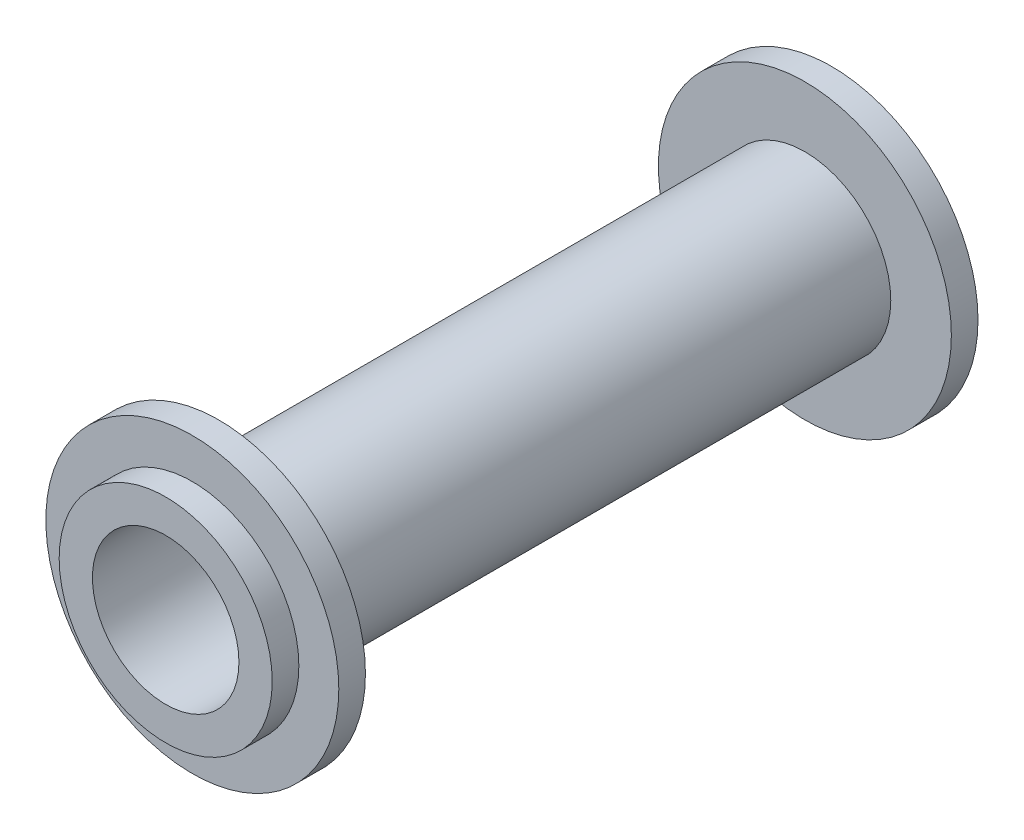
ISO-10303-21;
HEADER;
FILE_DESCRIPTION(('STEP AP214'),'2;1');
FILE_NAME('part.step','',(''),(''),'','','');
FILE_SCHEMA(('AUTOMOTIVE_DESIGN { 1 0 10303 214 1 1 1 1 }'));
ENDSEC;
DATA;
#1=APPLICATION_CONTEXT('core data for automotive mechanical design processes');
#2=APPLICATION_PROTOCOL_DEFINITION('international standard','automotive_design',2000,#1);
#3=PRODUCT_CONTEXT('',#1,'mechanical');
#4=PRODUCT('Part','Part','',(#3));
#5=PRODUCT_RELATED_PRODUCT_CATEGORY('part','',(#4));
#6=PRODUCT_DEFINITION_FORMATION('','',#4);
#7=PRODUCT_DEFINITION_CONTEXT('part definition',#1,'design');
#8=PRODUCT_DEFINITION('design','',#6,#7);
#9=PRODUCT_DEFINITION_SHAPE('','',#8);
#10=(LENGTH_UNIT() NAMED_UNIT(*) SI_UNIT(.MILLI.,.METRE.));
#11=(NAMED_UNIT(*) PLANE_ANGLE_UNIT() SI_UNIT($,.RADIAN.));
#12=(NAMED_UNIT(*) SI_UNIT($,.STERADIAN.) SOLID_ANGLE_UNIT());
#13=UNCERTAINTY_MEASURE_WITH_UNIT(LENGTH_MEASURE(1.E-05),#10,'distance_accuracy_value','');
#14=(GEOMETRIC_REPRESENTATION_CONTEXT(3) GLOBAL_UNCERTAINTY_ASSIGNED_CONTEXT((#13)) GLOBAL_UNIT_ASSIGNED_CONTEXT((#10,
#11,#12)) REPRESENTATION_CONTEXT('',''));
#15=CARTESIAN_POINT('',(0.,0.,0.));
#16=DIRECTION('',(0.,0.,1.));
#17=DIRECTION('',(1.,0.,0.));
#18=AXIS2_PLACEMENT_3D('',#15,#16,#17);
#19=CARTESIAN_POINT('',(0.,8.,0.));
#20=DIRECTION('',(0.,0.,-1.));
#21=DIRECTION('',(-1.,0.,0.));
#22=AXIS2_PLACEMENT_3D('',#19,#20,#21);
#23=PLANE('',#22);
#24=CARTESIAN_POINT('',(0.,0.,0.));
#25=DIRECTION('',(0.,0.,1.));
#26=DIRECTION('',(1.,0.,0.));
#27=AXIS2_PLACEMENT_3D('',#24,#25,#26);
#28=CIRCLE('',#27,5.5);
#29=CARTESIAN_POINT('',(5.5,0.,0.));
#30=VERTEX_POINT('',#29);
#31=EDGE_CURVE('E10',#30,#30,#28,.T.);
#32=ORIENTED_EDGE('',*,*,#31,.F.);
#33=EDGE_LOOP('',(#32));
#34=FACE_BOUND('',#33,.T.);
#35=CARTESIAN_POINT('',(0.,0.,0.));
#36=DIRECTION('',(0.,0.,1.));
#37=DIRECTION('',(1.,0.,0.));
#38=AXIS2_PLACEMENT_3D('',#35,#36,#37);
#39=CIRCLE('',#38,8.);
#40=CARTESIAN_POINT('',(8.,0.,0.));
#41=VERTEX_POINT('',#40);
#42=EDGE_CURVE('E71',#41,#41,#39,.T.);
#43=ORIENTED_EDGE('',*,*,#42,.T.);
#44=EDGE_LOOP('',(#43));
#45=FACE_BOUND('',#44,.T.);
#46=ADVANCED_FACE('F31',(#34,#45),#23,.F.);
#47=CARTESIAN_POINT('',(0.,0.,0.));
#48=DIRECTION('',(0.,0.,1.));
#49=DIRECTION('',(1.,0.,0.));
#50=AXIS2_PLACEMENT_3D('',#47,#48,#49);
#51=CYLINDRICAL_SURFACE('',#50,5.5);
#52=CARTESIAN_POINT('',(0.,0.,-52.));
#53=DIRECTION('',(0.,0.,1.));
#54=DIRECTION('',(1.,0.,0.));
#55=AXIS2_PLACEMENT_3D('',#52,#53,#54);
#56=CIRCLE('',#55,5.5);
#57=CARTESIAN_POINT('',(5.5,0.,-52.));
#58=VERTEX_POINT('',#57);
#59=EDGE_CURVE('E37',#58,#58,#56,.T.);
#60=ORIENTED_EDGE('',*,*,#59,.F.);
#61=EDGE_LOOP('',(#60));
#62=FACE_BOUND('',#61,.T.);
#63=ORIENTED_EDGE('',*,*,#31,.T.);
#64=EDGE_LOOP('',(#63));
#65=FACE_BOUND('',#64,.T.);
#66=ADVANCED_FACE('F132',(#62,#65),#51,.F.);
#67=CARTESIAN_POINT('',(0.,5.5,-52.));
#68=DIRECTION('',(0.,0.,1.));
#69=DIRECTION('',(1.,0.,0.));
#70=AXIS2_PLACEMENT_3D('',#67,#68,#69);
#71=PLANE('',#70);
#72=CARTESIAN_POINT('',(0.,0.,-52.));
#73=DIRECTION('',(0.,0.,1.));
#74=DIRECTION('',(1.,0.,0.));
#75=AXIS2_PLACEMENT_3D('',#72,#73,#74);
#76=CIRCLE('',#75,8.00000000000001);
#77=CARTESIAN_POINT('',(8.00000000000001,0.,-52.));
#78=VERTEX_POINT('',#77);
#79=EDGE_CURVE('E41',#78,#78,#76,.T.);
#80=ORIENTED_EDGE('',*,*,#79,.F.);
#81=EDGE_LOOP('',(#80));
#82=FACE_BOUND('',#81,.T.);
#83=ORIENTED_EDGE('',*,*,#59,.T.);
#84=EDGE_LOOP('',(#83));
#85=FACE_BOUND('',#84,.T.);
#86=ADVANCED_FACE('F127',(#82,#85),#71,.F.);
#87=CARTESIAN_POINT('',(0.,0.,0.));
#88=DIRECTION('',(0.,0.,1.));
#89=DIRECTION('',(1.,0.,0.));
#90=AXIS2_PLACEMENT_3D('',#87,#88,#89);
#91=CYLINDRICAL_SURFACE('',#90,8.00000000000001);
#92=CARTESIAN_POINT('',(0.,0.,-50.));
#93=DIRECTION('',(0.,0.,1.));
#94=DIRECTION('',(1.,0.,0.));
#95=AXIS2_PLACEMENT_3D('',#92,#93,#94);
#96=CIRCLE('',#95,8.00000000000001);
#97=CARTESIAN_POINT('',(8.00000000000001,0.,-50.));
#98=VERTEX_POINT('',#97);
#99=EDGE_CURVE('E45',#98,#98,#96,.T.);
#100=ORIENTED_EDGE('',*,*,#99,.F.);
#101=EDGE_LOOP('',(#100));
#102=FACE_BOUND('',#101,.T.);
#103=ORIENTED_EDGE('',*,*,#79,.T.);
#104=EDGE_LOOP('',(#103));
#105=FACE_BOUND('',#104,.T.);
#106=ADVANCED_FACE('F121',(#102,#105),#91,.T.);
#107=CARTESIAN_POINT('',(0.,8.00000000000001,-50.));
#108=DIRECTION('',(0.,0.,1.));
#109=DIRECTION('',(1.,0.,0.));
#110=AXIS2_PLACEMENT_3D('',#107,#108,#109);
#111=PLANE('',#110);
#112=CARTESIAN_POINT('',(0.,0.,-50.));
#113=DIRECTION('',(0.,0.,1.));
#114=DIRECTION('',(1.,0.,0.));
#115=AXIS2_PLACEMENT_3D('',#112,#113,#114);
#116=CIRCLE('',#115,11.);
#117=CARTESIAN_POINT('',(11.,0.,-50.));
#118=VERTEX_POINT('',#117);
#119=EDGE_CURVE('E50',#118,#118,#116,.T.);
#120=ORIENTED_EDGE('',*,*,#119,.F.);
#121=EDGE_LOOP('',(#120));
#122=FACE_BOUND('',#121,.T.);
#123=ORIENTED_EDGE('',*,*,#99,.T.);
#124=EDGE_LOOP('',(#123));
#125=FACE_BOUND('',#124,.T.);
#126=ADVANCED_FACE('F115',(#122,#125),#111,.F.);
#127=CARTESIAN_POINT('',(0.,0.,0.));
#128=DIRECTION('',(0.,0.,1.));
#129=DIRECTION('',(1.,0.,0.));
#130=AXIS2_PLACEMENT_3D('',#127,#128,#129);
#131=CYLINDRICAL_SURFACE('',#130,11.);
#132=CARTESIAN_POINT('',(0.,0.,-48.));
#133=DIRECTION('',(0.,0.,1.));
#134=DIRECTION('',(1.,0.,0.));
#135=AXIS2_PLACEMENT_3D('',#132,#133,#134);
#136=CIRCLE('',#135,11.);
#137=CARTESIAN_POINT('',(11.,0.,-48.));
#138=VERTEX_POINT('',#137);
#139=EDGE_CURVE('E53',#138,#138,#136,.T.);
#140=ORIENTED_EDGE('',*,*,#139,.F.);
#141=EDGE_LOOP('',(#140));
#142=FACE_BOUND('',#141,.T.);
#143=ORIENTED_EDGE('',*,*,#119,.T.);
#144=EDGE_LOOP('',(#143));
#145=FACE_BOUND('',#144,.T.);
#146=ADVANCED_FACE('F109',(#142,#145),#131,.T.);
#147=CARTESIAN_POINT('',(0.,11.,-48.));
#148=DIRECTION('',(0.,0.,-1.));
#149=DIRECTION('',(-1.,0.,0.));
#150=AXIS2_PLACEMENT_3D('',#147,#148,#149);
#151=PLANE('',#150);
#152=CARTESIAN_POINT('',(0.,0.,-48.));
#153=DIRECTION('',(0.,0.,1.));
#154=DIRECTION('',(1.,0.,0.));
#155=AXIS2_PLACEMENT_3D('',#152,#153,#154);
#156=CIRCLE('',#155,6.45);
#157=CARTESIAN_POINT('',(6.45,0.,-48.));
#158=VERTEX_POINT('',#157);
#159=EDGE_CURVE('E56',#158,#158,#156,.T.);
#160=ORIENTED_EDGE('',*,*,#159,.F.);
#161=EDGE_LOOP('',(#160));
#162=FACE_BOUND('',#161,.T.);
#163=ORIENTED_EDGE('',*,*,#139,.T.);
#164=EDGE_LOOP('',(#163));
#165=FACE_BOUND('',#164,.T.);
#166=ADVANCED_FACE('F103',(#162,#165),#151,.F.);
#167=CARTESIAN_POINT('',(0.,0.,0.));
#168=DIRECTION('',(0.,0.,1.));
#169=DIRECTION('',(1.,0.,0.));
#170=AXIS2_PLACEMENT_3D('',#167,#168,#169);
#171=CYLINDRICAL_SURFACE('',#170,6.44999999999999);
#172=CARTESIAN_POINT('',(0.,0.,-4.));
#173=DIRECTION('',(0.,0.,1.));
#174=DIRECTION('',(1.,0.,0.));
#175=AXIS2_PLACEMENT_3D('',#172,#173,#174);
#176=CIRCLE('',#175,6.44999999999999);
#177=CARTESIAN_POINT('',(6.44999999999999,0.,-4.));
#178=VERTEX_POINT('',#177);
#179=EDGE_CURVE('E59',#178,#178,#176,.T.);
#180=ORIENTED_EDGE('',*,*,#179,.F.);
#181=EDGE_LOOP('',(#180));
#182=FACE_BOUND('',#181,.T.);
#183=ORIENTED_EDGE('',*,*,#159,.T.);
#184=EDGE_LOOP('',(#183));
#185=FACE_BOUND('',#184,.T.);
#186=ADVANCED_FACE('F97',(#182,#185),#171,.T.);
#187=CARTESIAN_POINT('',(0.,6.44999999999999,-4.));
#188=DIRECTION('',(0.,0.,1.));
#189=DIRECTION('',(1.,0.,0.));
#190=AXIS2_PLACEMENT_3D('',#187,#188,#189);
#191=PLANE('',#190);
#192=CARTESIAN_POINT('',(0.,0.,-4.));
#193=DIRECTION('',(0.,0.,1.));
#194=DIRECTION('',(1.,0.,0.));
#195=AXIS2_PLACEMENT_3D('',#192,#193,#194);
#196=CIRCLE('',#195,11.);
#197=CARTESIAN_POINT('',(11.,0.,-4.));
#198=VERTEX_POINT('',#197);
#199=EDGE_CURVE('E62',#198,#198,#196,.T.);
#200=ORIENTED_EDGE('',*,*,#199,.F.);
#201=EDGE_LOOP('',(#200));
#202=FACE_BOUND('',#201,.T.);
#203=ORIENTED_EDGE('',*,*,#179,.T.);
#204=EDGE_LOOP('',(#203));
#205=FACE_BOUND('',#204,.T.);
#206=ADVANCED_FACE('F91',(#202,#205),#191,.F.);
#207=CARTESIAN_POINT('',(0.,0.,0.));
#208=DIRECTION('',(0.,0.,1.));
#209=DIRECTION('',(1.,0.,0.));
#210=AXIS2_PLACEMENT_3D('',#207,#208,#209);
#211=CYLINDRICAL_SURFACE('',#210,11.);
#212=CARTESIAN_POINT('',(0.,0.,-2.));
#213=DIRECTION('',(0.,0.,1.));
#214=DIRECTION('',(1.,0.,0.));
#215=AXIS2_PLACEMENT_3D('',#212,#213,#214);
#216=CIRCLE('',#215,11.);
#217=CARTESIAN_POINT('',(11.,0.,-2.));
#218=VERTEX_POINT('',#217);
#219=EDGE_CURVE('E65',#218,#218,#216,.T.);
#220=ORIENTED_EDGE('',*,*,#219,.F.);
#221=EDGE_LOOP('',(#220));
#222=FACE_BOUND('',#221,.T.);
#223=ORIENTED_EDGE('',*,*,#199,.T.);
#224=EDGE_LOOP('',(#223));
#225=FACE_BOUND('',#224,.T.);
#226=ADVANCED_FACE('F85',(#222,#225),#211,.T.);
#227=CARTESIAN_POINT('',(0.,11.,-2.));
#228=DIRECTION('',(0.,0.,-1.));
#229=DIRECTION('',(-1.,0.,0.));
#230=AXIS2_PLACEMENT_3D('',#227,#228,#229);
#231=PLANE('',#230);
#232=CARTESIAN_POINT('',(0.,0.,-2.));
#233=DIRECTION('',(0.,0.,1.));
#234=DIRECTION('',(1.,0.,0.));
#235=AXIS2_PLACEMENT_3D('',#232,#233,#234);
#236=CIRCLE('',#235,8.);
#237=CARTESIAN_POINT('',(8.,0.,-2.));
#238=VERTEX_POINT('',#237);
#239=EDGE_CURVE('E68',#238,#238,#236,.T.);
#240=ORIENTED_EDGE('',*,*,#239,.F.);
#241=EDGE_LOOP('',(#240));
#242=FACE_BOUND('',#241,.T.);
#243=ORIENTED_EDGE('',*,*,#219,.T.);
#244=EDGE_LOOP('',(#243));
#245=FACE_BOUND('',#244,.T.);
#246=ADVANCED_FACE('F79',(#242,#245),#231,.F.);
#247=CARTESIAN_POINT('',(0.,0.,0.));
#248=DIRECTION('',(0.,0.,1.));
#249=DIRECTION('',(1.,0.,0.));
#250=AXIS2_PLACEMENT_3D('',#247,#248,#249);
#251=CYLINDRICAL_SURFACE('',#250,8.);
#252=ORIENTED_EDGE('',*,*,#42,.F.);
#253=EDGE_LOOP('',(#252));
#254=FACE_BOUND('',#253,.T.);
#255=ORIENTED_EDGE('',*,*,#239,.T.);
#256=EDGE_LOOP('',(#255));
#257=FACE_BOUND('',#256,.T.);
#258=ADVANCED_FACE('F76',(#254,#257),#251,.T.);
#259=CLOSED_SHELL('',(#46,#66,#86,#106,#126,#146,#166,#186,#206,#226,#246,#258));
#260=MANIFOLD_SOLID_BREP('B2',#259);
#261=ADVANCED_BREP_SHAPE_REPRESENTATION('',(#18,#260),#14);
#262=SHAPE_DEFINITION_REPRESENTATION(#9,#261);
ENDSEC;
END-ISO-10303-21;
